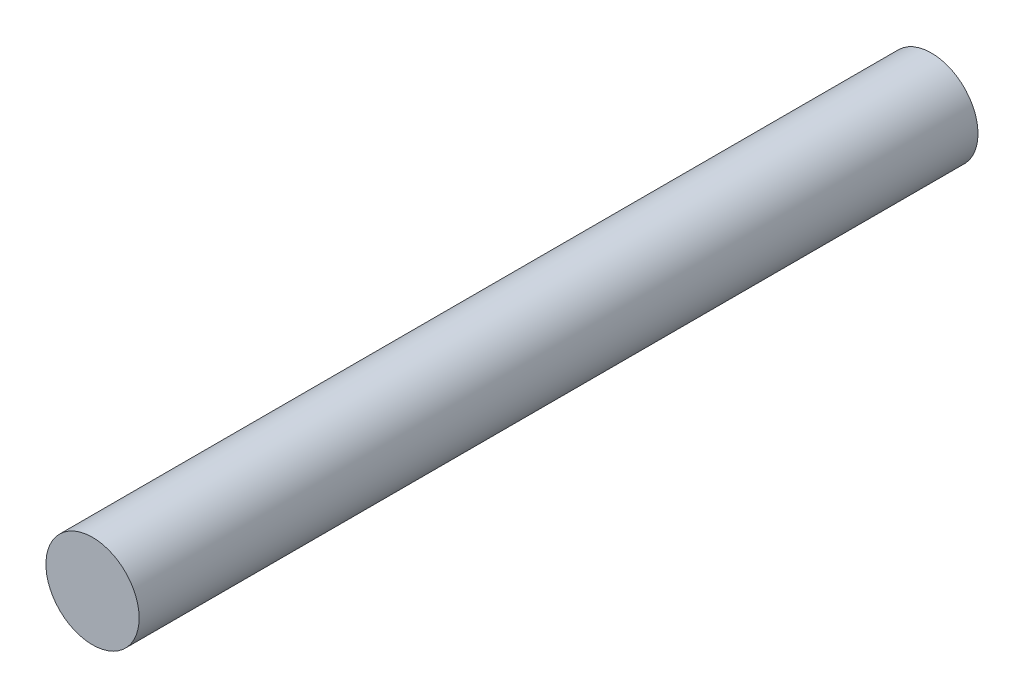
ISO-10303-21;
HEADER;
FILE_DESCRIPTION(('STEP AP214'),'2;1');
FILE_NAME('part.step','',(''),(''),'','','');
FILE_SCHEMA(('AUTOMOTIVE_DESIGN { 1 0 10303 214 1 1 1 1 }'));
ENDSEC;
DATA;
#1=APPLICATION_CONTEXT('core data for automotive mechanical design processes');
#2=APPLICATION_PROTOCOL_DEFINITION('international standard','automotive_design',2000,#1);
#3=PRODUCT_CONTEXT('',#1,'mechanical');
#4=PRODUCT('Part','Part','',(#3));
#5=PRODUCT_RELATED_PRODUCT_CATEGORY('part','',(#4));
#6=PRODUCT_DEFINITION_FORMATION('','',#4);
#7=PRODUCT_DEFINITION_CONTEXT('part definition',#1,'design');
#8=PRODUCT_DEFINITION('design','',#6,#7);
#9=PRODUCT_DEFINITION_SHAPE('','',#8);
#10=(LENGTH_UNIT() NAMED_UNIT(*) SI_UNIT(.MILLI.,.METRE.));
#11=(NAMED_UNIT(*) PLANE_ANGLE_UNIT() SI_UNIT($,.RADIAN.));
#12=(NAMED_UNIT(*) SI_UNIT($,.STERADIAN.) SOLID_ANGLE_UNIT());
#13=UNCERTAINTY_MEASURE_WITH_UNIT(LENGTH_MEASURE(1.E-05),#10,'distance_accuracy_value','');
#14=(GEOMETRIC_REPRESENTATION_CONTEXT(3) GLOBAL_UNCERTAINTY_ASSIGNED_CONTEXT((#13)) GLOBAL_UNIT_ASSIGNED_CONTEXT((#10,
#11,#12)) REPRESENTATION_CONTEXT('',''));
#15=CARTESIAN_POINT('',(0.,0.,0.));
#16=DIRECTION('',(0.,0.,1.));
#17=DIRECTION('',(1.,0.,0.));
#18=AXIS2_PLACEMENT_3D('',#15,#16,#17);
#19=CARTESIAN_POINT('',(-0.924,3.899,-9.1));
#20=DIRECTION('',(0.,0.,-1.));
#21=DIRECTION('',(-1.,0.,0.));
#22=AXIS2_PLACEMENT_3D('',#19,#20,#21);
#23=PLANE('',#22);
#24=CARTESIAN_POINT('',(-1.225,4.2,-9.1));
#25=DIRECTION('',(0.,0.,1.));
#26=DIRECTION('',(1.,0.,0.));
#27=AXIS2_PLACEMENT_3D('',#24,#25,#26);
#28=CIRCLE('',#27,0.3);
#29=CARTESIAN_POINT('',(-0.925,4.2,-9.1));
#30=VERTEX_POINT('',#29);
#31=EDGE_CURVE('E19',#30,#30,#28,.T.);
#32=ORIENTED_EDGE('',*,*,#31,.F.);
#33=EDGE_LOOP('',(#32));
#34=FACE_BOUND('',#33,.T.);
#35=ADVANCED_FACE('F15',(#34),#23,.T.);
#36=CARTESIAN_POINT('',(-1.225,4.2,-9.1));
#37=DIRECTION('',(0.,0.,1.));
#38=DIRECTION('',(1.,0.,0.));
#39=AXIS2_PLACEMENT_3D('',#36,#37,#38);
#40=CYLINDRICAL_SURFACE('',#39,0.3);
#41=CARTESIAN_POINT('',(-1.225,4.2,-3.7));
#42=DIRECTION('',(0.,0.,1.));
#43=DIRECTION('',(1.,0.,0.));
#44=AXIS2_PLACEMENT_3D('',#41,#42,#43);
#45=CIRCLE('',#44,0.3);
#46=CARTESIAN_POINT('',(-0.925,4.2,-3.7));
#47=VERTEX_POINT('',#46);
#48=EDGE_CURVE('E10',#47,#47,#45,.T.);
#49=ORIENTED_EDGE('',*,*,#48,.F.);
#50=EDGE_LOOP('',(#49));
#51=FACE_BOUND('',#50,.T.);
#52=ORIENTED_EDGE('',*,*,#31,.T.);
#53=EDGE_LOOP('',(#52));
#54=FACE_BOUND('',#53,.T.);
#55=ADVANCED_FACE('F28',(#51,#54),#40,.T.);
#56=CARTESIAN_POINT('',(-0.924,4.501,-3.7));
#57=DIRECTION('',(0.,0.,1.));
#58=DIRECTION('',(-1.,0.,0.));
#59=AXIS2_PLACEMENT_3D('',#56,#57,#58);
#60=PLANE('',#59);
#61=ORIENTED_EDGE('',*,*,#48,.T.);
#62=EDGE_LOOP('',(#61));
#63=FACE_BOUND('',#62,.T.);
#64=ADVANCED_FACE('F17',(#63),#60,.T.);
#65=CLOSED_SHELL('',(#35,#55,#64));
#66=MANIFOLD_SOLID_BREP('B1',#65);
#67=ADVANCED_BREP_SHAPE_REPRESENTATION('',(#18,#66),#14);
#68=SHAPE_DEFINITION_REPRESENTATION(#9,#67);
ENDSEC;
END-ISO-10303-21;
